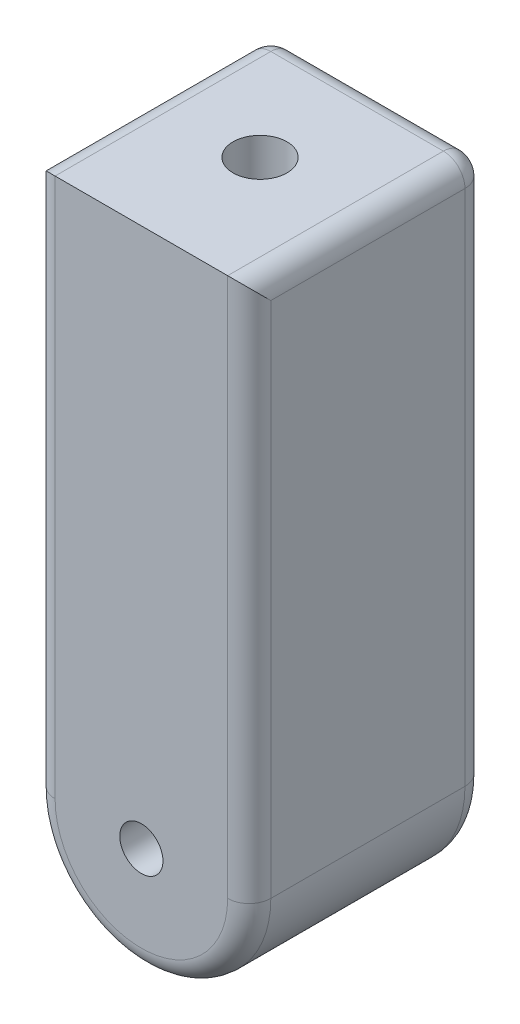
ISO-10303-21;
HEADER;
FILE_DESCRIPTION(('STEP AP214'),'2;1');
FILE_NAME('part.step','',(''),(''),'','','');
FILE_SCHEMA(('AUTOMOTIVE_DESIGN { 1 0 10303 214 1 1 1 1 }'));
ENDSEC;
DATA;
#1=APPLICATION_CONTEXT('core data for automotive mechanical design processes');
#2=APPLICATION_PROTOCOL_DEFINITION('international standard','automotive_design',2000,#1);
#3=PRODUCT_CONTEXT('',#1,'mechanical');
#4=PRODUCT('Part','Part','',(#3));
#5=PRODUCT_RELATED_PRODUCT_CATEGORY('part','',(#4));
#6=PRODUCT_DEFINITION_FORMATION('','',#4);
#7=PRODUCT_DEFINITION_CONTEXT('part definition',#1,'design');
#8=PRODUCT_DEFINITION('design','',#6,#7);
#9=PRODUCT_DEFINITION_SHAPE('','',#8);
#10=(LENGTH_UNIT() NAMED_UNIT(*) SI_UNIT(.MILLI.,.METRE.));
#11=(NAMED_UNIT(*) PLANE_ANGLE_UNIT() SI_UNIT($,.RADIAN.));
#12=(NAMED_UNIT(*) SI_UNIT($,.STERADIAN.) SOLID_ANGLE_UNIT());
#13=UNCERTAINTY_MEASURE_WITH_UNIT(LENGTH_MEASURE(1.E-05),#10,'distance_accuracy_value','');
#14=(GEOMETRIC_REPRESENTATION_CONTEXT(3) GLOBAL_UNCERTAINTY_ASSIGNED_CONTEXT((#13)) GLOBAL_UNIT_ASSIGNED_CONTEXT((#10,
#11,#12)) REPRESENTATION_CONTEXT('',''));
#15=CARTESIAN_POINT('',(0.,0.,0.));
#16=DIRECTION('',(0.,0.,1.));
#17=DIRECTION('',(1.,0.,0.));
#18=AXIS2_PLACEMENT_3D('',#15,#16,#17);
#19=CARTESIAN_POINT('',(50.,0.,55.));
#20=DIRECTION('',(1.,0.,0.));
#21=DIRECTION('',(0.,1.,0.));
#22=AXIS2_PLACEMENT_3D('',#19,#20,#21);
#23=PLANE('',#22);
#24=DIRECTION('',(0.,0.,-1.));
#25=VECTOR('',#24,1.);
#26=CARTESIAN_POINT('',(50.,-150.,55.));
#27=LINE('',#26,#25);
#28=CARTESIAN_POINT('',(50.,-150.,45.));
#29=VERTEX_POINT('',#28);
#30=CARTESIAN_POINT('',(50.,-150.,-45.));
#31=VERTEX_POINT('',#30);
#32=EDGE_CURVE('E136',#29,#31,#27,.T.);
#33=ORIENTED_EDGE('',*,*,#32,.T.);
#34=DIRECTION('',(0.,-1.,0.));
#35=VECTOR('',#34,1.);
#36=CARTESIAN_POINT('',(50.,100.,-45.));
#37=LINE('',#36,#35);
#38=CARTESIAN_POINT('',(50.,90.,-45.));
#39=VERTEX_POINT('',#38);
#40=EDGE_CURVE('E51',#31,#39,#37,.F.);
#41=ORIENTED_EDGE('',*,*,#40,.T.);
#42=DIRECTION('',(0.,0.,-1.));
#43=VECTOR('',#42,1.);
#44=CARTESIAN_POINT('',(50.,90.,55.));
#45=LINE('',#44,#43);
#46=CARTESIAN_POINT('',(50.,90.,45.));
#47=VERTEX_POINT('',#46);
#48=EDGE_CURVE('E63',#39,#47,#45,.F.);
#49=ORIENTED_EDGE('',*,*,#48,.T.);
#50=DIRECTION('',(0.,-1.,0.));
#51=VECTOR('',#50,1.);
#52=CARTESIAN_POINT('',(50.,0.,45.));
#53=LINE('',#52,#51);
#54=EDGE_CURVE('E126',#47,#29,#53,.T.);
#55=ORIENTED_EDGE('',*,*,#54,.T.);
#56=EDGE_LOOP('',(#33,#41,#49,#55));
#57=FACE_BOUND('',#56,.T.);
#58=ADVANCED_FACE('F41',(#57),#23,.T.);
#59=CARTESIAN_POINT('',(0.,100.,55.));
#60=DIRECTION('',(0.,1.,0.));
#61=DIRECTION('',(0.,0.,1.));
#62=AXIS2_PLACEMENT_3D('',#59,#60,#61);
#63=PLANE('',#62);
#64=CARTESIAN_POINT('',(0.,100.,0.));
#65=DIRECTION('',(0.,1.,0.));
#66=DIRECTION('',(0.,0.,1.));
#67=AXIS2_PLACEMENT_3D('',#64,#65,#66);
#68=CIRCLE('',#67,12.5);
#69=CARTESIAN_POINT('',(0.,100.,12.5));
#70=VERTEX_POINT('',#69);
#71=EDGE_CURVE('E241',#70,#70,#68,.T.);
#72=ORIENTED_EDGE('',*,*,#71,.F.);
#73=EDGE_LOOP('',(#72));
#74=FACE_BOUND('',#73,.T.);
#75=DIRECTION('',(1.,0.,0.));
#76=VECTOR('',#75,1.);
#77=CARTESIAN_POINT('',(-50.,100.,-45.));
#78=LINE('',#77,#76);
#79=CARTESIAN_POINT('',(40.,100.,-45.));
#80=VERTEX_POINT('',#79);
#81=CARTESIAN_POINT('',(-40.,100.,-45.));
#82=VERTEX_POINT('',#81);
#83=EDGE_CURVE('E120',#80,#82,#78,.F.);
#84=ORIENTED_EDGE('',*,*,#83,.T.);
#85=DIRECTION('',(0.,0.,-1.));
#86=VECTOR('',#85,1.);
#87=CARTESIAN_POINT('',(-40.,100.,55.));
#88=LINE('',#87,#86);
#89=CARTESIAN_POINT('',(-40.,100.,55.));
#90=VERTEX_POINT('',#89);
#91=EDGE_CURVE('E114',#82,#90,#88,.F.);
#92=ORIENTED_EDGE('',*,*,#91,.T.);
#93=DIRECTION('',(1.,0.,0.));
#94=VECTOR('',#93,1.);
#95=CARTESIAN_POINT('',(0.,100.,55.));
#96=LINE('',#95,#94);
#97=CARTESIAN_POINT('',(40.,100.,55.));
#98=VERTEX_POINT('',#97);
#99=EDGE_CURVE('E117',#90,#98,#96,.T.);
#100=ORIENTED_EDGE('',*,*,#99,.T.);
#101=DIRECTION('',(0.,0.,-1.));
#102=VECTOR('',#101,1.);
#103=CARTESIAN_POINT('',(40.,100.,55.));
#104=LINE('',#103,#102);
#105=EDGE_CURVE('E191',#98,#80,#104,.T.);
#106=ORIENTED_EDGE('',*,*,#105,.T.);
#107=EDGE_LOOP('',(#84,#92,#100,#106));
#108=FACE_BOUND('',#107,.T.);
#109=ADVANCED_FACE('F116',(#74,#108),#63,.T.);
#110=CARTESIAN_POINT('',(-50.,0.,55.));
#111=DIRECTION('',(1.,0.,0.));
#112=DIRECTION('',(0.,1.,0.));
#113=AXIS2_PLACEMENT_3D('',#110,#111,#112);
#114=PLANE('',#113);
#115=DIRECTION('',(0.,0.,-1.));
#116=VECTOR('',#115,1.);
#117=CARTESIAN_POINT('',(-50.,-150.,55.));
#118=LINE('',#117,#116);
#119=CARTESIAN_POINT('',(-50.,-150.,45.));
#120=VERTEX_POINT('',#119);
#121=CARTESIAN_POINT('',(-50.,-150.,-45.));
#122=VERTEX_POINT('',#121);
#123=EDGE_CURVE('E261',#120,#122,#118,.T.);
#124=ORIENTED_EDGE('',*,*,#123,.F.);
#125=DIRECTION('',(0.,-1.,0.));
#126=VECTOR('',#125,1.);
#127=CARTESIAN_POINT('',(-50.,100.,45.));
#128=LINE('',#127,#126);
#129=CARTESIAN_POINT('',(-50.,90.,45.));
#130=VERTEX_POINT('',#129);
#131=EDGE_CURVE('E165',#120,#130,#128,.F.);
#132=ORIENTED_EDGE('',*,*,#131,.T.);
#133=DIRECTION('',(0.,0.,-1.));
#134=VECTOR('',#133,1.);
#135=CARTESIAN_POINT('',(-50.,90.,-55.));
#136=LINE('',#135,#134);
#137=CARTESIAN_POINT('',(-50.,90.,-45.));
#138=VERTEX_POINT('',#137);
#139=EDGE_CURVE('E142',#130,#138,#136,.T.);
#140=ORIENTED_EDGE('',*,*,#139,.T.);
#141=DIRECTION('',(0.,-1.,0.));
#142=VECTOR('',#141,1.);
#143=CARTESIAN_POINT('',(-50.,0.,-45.));
#144=LINE('',#143,#142);
#145=EDGE_CURVE('E158',#138,#122,#144,.T.);
#146=ORIENTED_EDGE('',*,*,#145,.T.);
#147=EDGE_LOOP('',(#124,#132,#140,#146));
#148=FACE_BOUND('',#147,.T.);
#149=ADVANCED_FACE('F309',(#148),#114,.F.);
#150=CARTESIAN_POINT('',(0.,-150.,55.));
#151=DIRECTION('',(0.,0.,-1.));
#152=DIRECTION('',(-1.,0.,0.));
#153=AXIS2_PLACEMENT_3D('',#150,#151,#152);
#154=CYLINDRICAL_SURFACE('',#153,50.);
#155=ORIENTED_EDGE('',*,*,#32,.F.);
#156=CARTESIAN_POINT('',(0.,-150.,45.));
#157=DIRECTION('',(0.,0.,1.));
#158=DIRECTION('',(1.,0.,0.));
#159=AXIS2_PLACEMENT_3D('',#156,#157,#158);
#160=CIRCLE('',#159,50.);
#161=EDGE_CURVE('E171',#29,#120,#160,.F.);
#162=ORIENTED_EDGE('',*,*,#161,.T.);
#163=ORIENTED_EDGE('',*,*,#123,.T.);
#164=CARTESIAN_POINT('',(0.,-150.,-45.));
#165=DIRECTION('',(0.,0.,1.));
#166=DIRECTION('',(1.,0.,0.));
#167=AXIS2_PLACEMENT_3D('',#164,#165,#166);
#168=CIRCLE('',#167,50.);
#169=EDGE_CURVE('E168',#122,#31,#168,.T.);
#170=ORIENTED_EDGE('',*,*,#169,.T.);
#171=EDGE_LOOP('',(#155,#162,#163,#170));
#172=FACE_BOUND('',#171,.T.);
#173=ADVANCED_FACE('F268',(#172),#154,.T.);
#174=CARTESIAN_POINT('',(0.,0.,55.));
#175=DIRECTION('',(0.,0.,1.));
#176=DIRECTION('',(1.,0.,0.));
#177=AXIS2_PLACEMENT_3D('',#174,#175,#176);
#178=PLANE('',#177);
#179=CARTESIAN_POINT('',(0.,-150.,55.));
#180=DIRECTION('',(0.,0.,1.));
#181=DIRECTION('',(1.,0.,0.));
#182=AXIS2_PLACEMENT_3D('',#179,#180,#181);
#183=CIRCLE('',#182,10.);
#184=CARTESIAN_POINT('',(10.,-150.,55.));
#185=VERTEX_POINT('',#184);
#186=EDGE_CURVE('E137',#185,#185,#183,.T.);
#187=ORIENTED_EDGE('',*,*,#186,.F.);
#188=EDGE_LOOP('',(#187));
#189=FACE_BOUND('',#188,.T.);
#190=ORIENTED_EDGE('',*,*,#99,.F.);
#191=DIRECTION('',(0.,-1.,0.));
#192=VECTOR('',#191,1.);
#193=CARTESIAN_POINT('',(-40.,-150.,55.));
#194=LINE('',#193,#192);
#195=CARTESIAN_POINT('',(-40.,-150.,55.));
#196=VERTEX_POINT('',#195);
#197=EDGE_CURVE('E132',#90,#196,#194,.T.);
#198=ORIENTED_EDGE('',*,*,#197,.T.);
#199=CARTESIAN_POINT('',(0.,-150.,55.));
#200=DIRECTION('',(0.,0.,1.));
#201=DIRECTION('',(1.,0.,0.));
#202=AXIS2_PLACEMENT_3D('',#199,#200,#201);
#203=CIRCLE('',#202,40.);
#204=CARTESIAN_POINT('',(40.,-150.,55.));
#205=VERTEX_POINT('',#204);
#206=EDGE_CURVE('E154',#196,#205,#203,.T.);
#207=ORIENTED_EDGE('',*,*,#206,.T.);
#208=DIRECTION('',(0.,-1.,0.));
#209=VECTOR('',#208,1.);
#210=CARTESIAN_POINT('',(40.,0.,55.));
#211=LINE('',#210,#209);
#212=EDGE_CURVE('E134',#205,#98,#211,.F.);
#213=ORIENTED_EDGE('',*,*,#212,.T.);
#214=EDGE_LOOP('',(#190,#198,#207,#213));
#215=FACE_BOUND('',#214,.T.);
#216=ADVANCED_FACE('F130',(#189,#215),#178,.T.);
#217=CARTESIAN_POINT('',(0.,0.,-55.));
#218=DIRECTION('',(0.,0.,1.));
#219=DIRECTION('',(1.,0.,0.));
#220=AXIS2_PLACEMENT_3D('',#217,#218,#219);
#221=PLANE('',#220);
#222=DIRECTION('',(0.,-1.,0.));
#223=VECTOR('',#222,1.);
#224=CARTESIAN_POINT('',(-40.,0.,-55.));
#225=LINE('',#224,#223);
#226=CARTESIAN_POINT('',(-40.,-150.,-55.));
#227=VERTEX_POINT('',#226);
#228=CARTESIAN_POINT('',(-40.,90.,-55.));
#229=VERTEX_POINT('',#228);
#230=EDGE_CURVE('E184',#227,#229,#225,.F.);
#231=ORIENTED_EDGE('',*,*,#230,.T.);
#232=DIRECTION('',(1.,0.,0.));
#233=VECTOR('',#232,1.);
#234=CARTESIAN_POINT('',(50.,90.,-55.));
#235=LINE('',#234,#233);
#236=CARTESIAN_POINT('',(40.,90.,-55.));
#237=VERTEX_POINT('',#236);
#238=EDGE_CURVE('E187',#229,#237,#235,.T.);
#239=ORIENTED_EDGE('',*,*,#238,.T.);
#240=DIRECTION('',(0.,-1.,0.));
#241=VECTOR('',#240,1.);
#242=CARTESIAN_POINT('',(40.,-150.,-55.));
#243=LINE('',#242,#241);
#244=CARTESIAN_POINT('',(40.,-150.,-55.));
#245=VERTEX_POINT('',#244);
#246=EDGE_CURVE('E178',#237,#245,#243,.T.);
#247=ORIENTED_EDGE('',*,*,#246,.T.);
#248=CARTESIAN_POINT('',(0.,-150.,-55.));
#249=DIRECTION('',(0.,0.,1.));
#250=DIRECTION('',(1.,0.,0.));
#251=AXIS2_PLACEMENT_3D('',#248,#249,#250);
#252=CIRCLE('',#251,40.);
#253=EDGE_CURVE('E181',#245,#227,#252,.F.);
#254=ORIENTED_EDGE('',*,*,#253,.T.);
#255=EDGE_LOOP('',(#231,#239,#247,#254));
#256=FACE_BOUND('',#255,.T.);
#257=CARTESIAN_POINT('',(0.,-150.,-55.));
#258=DIRECTION('',(0.,0.,1.));
#259=DIRECTION('',(1.,0.,0.));
#260=AXIS2_PLACEMENT_3D('',#257,#258,#259);
#261=CIRCLE('',#260,20.);
#262=CARTESIAN_POINT('',(20.,-150.,-55.));
#263=VERTEX_POINT('',#262);
#264=EDGE_CURVE('E174',#263,#263,#261,.T.);
#265=ORIENTED_EDGE('',*,*,#264,.T.);
#266=EDGE_LOOP('',(#265));
#267=FACE_BOUND('',#266,.T.);
#268=ADVANCED_FACE('F280',(#256,#267),#221,.F.);
#269=CARTESIAN_POINT('',(0.,-150.,-83.2842712474619));
#270=DIRECTION('',(0.,0.,1.));
#271=DIRECTION('',(1.,0.,0.));
#272=AXIS2_PLACEMENT_3D('',#269,#270,#271);
#273=CYLINDRICAL_SURFACE('',#272,10.);
#274=CARTESIAN_POINT('',(0.,-150.,-45.));
#275=DIRECTION('',(0.,0.,1.));
#276=DIRECTION('',(1.,0.,0.));
#277=AXIS2_PLACEMENT_3D('',#274,#275,#276);
#278=CIRCLE('',#277,10.);
#279=CARTESIAN_POINT('',(10.,-150.,-45.));
#280=VERTEX_POINT('',#279);
#281=EDGE_CURVE('E11',#280,#280,#278,.F.);
#282=ORIENTED_EDGE('',*,*,#281,.T.);
#283=EDGE_LOOP('',(#282));
#284=FACE_BOUND('',#283,.T.);
#285=ORIENTED_EDGE('',*,*,#186,.T.);
#286=EDGE_LOOP('',(#285));
#287=FACE_BOUND('',#286,.T.);
#288=ADVANCED_FACE('F419',(#284,#287),#273,.F.);
#289=CARTESIAN_POINT('',(0.,0.,0.));
#290=DIRECTION('',(0.,1.,0.));
#291=DIRECTION('',(0.,0.,1.));
#292=AXIS2_PLACEMENT_3D('',#289,#290,#291);
#293=CYLINDRICAL_SURFACE('',#292,12.5);
#294=CARTESIAN_POINT('',(0.,0.,0.));
#295=DIRECTION('',(0.,1.,0.));
#296=DIRECTION('',(0.,0.,1.));
#297=AXIS2_PLACEMENT_3D('',#294,#295,#296);
#298=CIRCLE('',#297,12.5);
#299=CARTESIAN_POINT('',(0.,0.,12.5));
#300=VERTEX_POINT('',#299);
#301=EDGE_CURVE('E248',#300,#300,#298,.T.);
#302=ORIENTED_EDGE('',*,*,#301,.F.);
#303=EDGE_LOOP('',(#302));
#304=FACE_BOUND('',#303,.T.);
#305=ORIENTED_EDGE('',*,*,#71,.T.);
#306=EDGE_LOOP('',(#305));
#307=FACE_BOUND('',#306,.T.);
#308=ADVANCED_FACE('F301',(#304,#307),#293,.F.);
#309=CARTESIAN_POINT('',(0.,0.,0.));
#310=DIRECTION('',(0.,1.,0.));
#311=DIRECTION('',(0.,0.,1.));
#312=AXIS2_PLACEMENT_3D('',#309,#310,#311);
#313=PLANE('',#312);
#314=ORIENTED_EDGE('',*,*,#301,.T.);
#315=EDGE_LOOP('',(#314));
#316=FACE_BOUND('',#315,.T.);
#317=ADVANCED_FACE('F295',(#316),#313,.T.);
#318=CARTESIAN_POINT('',(40.,0.,-45.));
#319=DIRECTION('',(0.,1.,0.));
#320=DIRECTION('',(-1.,0.,0.));
#321=AXIS2_PLACEMENT_3D('',#318,#319,#320);
#322=CYLINDRICAL_SURFACE('',#321,10.);
#323=CARTESIAN_POINT('',(40.,90.,-45.));
#324=DIRECTION('',(0.,1.,0.));
#325=DIRECTION('',(0.,0.,1.));
#326=AXIS2_PLACEMENT_3D('',#323,#324,#325);
#327=CIRCLE('',#326,10.);
#328=EDGE_CURVE('E232',#39,#237,#327,.T.);
#329=ORIENTED_EDGE('',*,*,#328,.F.);
#330=ORIENTED_EDGE('',*,*,#40,.F.);
#331=CARTESIAN_POINT('',(40.,-150.,-45.));
#332=DIRECTION('',(0.,-1.,0.));
#333=DIRECTION('',(0.,0.,-1.));
#334=AXIS2_PLACEMENT_3D('',#331,#332,#333);
#335=CIRCLE('',#334,10.);
#336=EDGE_CURVE('E45',#245,#31,#335,.T.);
#337=ORIENTED_EDGE('',*,*,#336,.F.);
#338=ORIENTED_EDGE('',*,*,#246,.F.);
#339=EDGE_LOOP('',(#329,#330,#337,#338));
#340=FACE_BOUND('',#339,.T.);
#341=ADVANCED_FACE('F293',(#340),#322,.T.);
#342=CARTESIAN_POINT('',(0.,-150.,-45.));
#343=DIRECTION('',(0.,0.,1.));
#344=DIRECTION('',(1.,0.,0.));
#345=AXIS2_PLACEMENT_3D('',#342,#343,#344);
#346=TOROIDAL_SURFACE('',#345,40.,10.);
#347=ORIENTED_EDGE('',*,*,#336,.T.);
#348=ORIENTED_EDGE('',*,*,#169,.F.);
#349=CARTESIAN_POINT('',(-40.,-150.,-45.));
#350=DIRECTION('',(0.,1.,0.));
#351=DIRECTION('',(0.,0.,1.));
#352=AXIS2_PLACEMENT_3D('',#349,#350,#351);
#353=CIRCLE('',#352,10.);
#354=EDGE_CURVE('E229',#227,#122,#353,.T.);
#355=ORIENTED_EDGE('',*,*,#354,.F.);
#356=ORIENTED_EDGE('',*,*,#253,.F.);
#357=EDGE_LOOP('',(#347,#348,#355,#356));
#358=FACE_BOUND('',#357,.T.);
#359=ADVANCED_FACE('F272',(#358),#346,.T.);
#360=CARTESIAN_POINT('',(40.,90.,-45.));
#361=DIRECTION('',(0.,0.,-1.));
#362=DIRECTION('',(-1.,0.,0.));
#363=AXIS2_PLACEMENT_3D('',#360,#361,#362);
#364=SPHERICAL_SURFACE('',#363,10.);
#365=CARTESIAN_POINT('',(40.,90.,-45.));
#366=DIRECTION('',(0.,0.,-1.));
#367=DIRECTION('',(-1.,0.,0.));
#368=AXIS2_PLACEMENT_3D('',#365,#366,#367);
#369=CIRCLE('',#368,10.);
#370=EDGE_CURVE('E222',#39,#80,#369,.F.);
#371=ORIENTED_EDGE('',*,*,#370,.F.);
#372=ORIENTED_EDGE('',*,*,#328,.T.);
#373=CARTESIAN_POINT('',(40.,90.,-45.));
#374=DIRECTION('',(1.,0.,0.));
#375=DIRECTION('',(0.,1.,0.));
#376=AXIS2_PLACEMENT_3D('',#373,#374,#375);
#377=CIRCLE('',#376,10.);
#378=EDGE_CURVE('E226',#80,#237,#377,.F.);
#379=ORIENTED_EDGE('',*,*,#378,.F.);
#380=EDGE_LOOP('',(#371,#372,#379));
#381=FACE_BOUND('',#380,.T.);
#382=ADVANCED_FACE('F285',(#381),#364,.T.);
#383=CARTESIAN_POINT('',(-40.,0.,-45.));
#384=DIRECTION('',(0.,-1.,0.));
#385=DIRECTION('',(1.,0.,0.));
#386=AXIS2_PLACEMENT_3D('',#383,#384,#385);
#387=CYLINDRICAL_SURFACE('',#386,10.);
#388=ORIENTED_EDGE('',*,*,#354,.T.);
#389=ORIENTED_EDGE('',*,*,#145,.F.);
#390=CARTESIAN_POINT('',(-40.,90.,-45.));
#391=DIRECTION('',(0.,1.,0.));
#392=DIRECTION('',(0.,0.,1.));
#393=AXIS2_PLACEMENT_3D('',#390,#391,#392);
#394=CIRCLE('',#393,10.);
#395=EDGE_CURVE('E218',#229,#138,#394,.T.);
#396=ORIENTED_EDGE('',*,*,#395,.F.);
#397=ORIENTED_EDGE('',*,*,#230,.F.);
#398=EDGE_LOOP('',(#388,#389,#396,#397));
#399=FACE_BOUND('',#398,.T.);
#400=ADVANCED_FACE('F276',(#399),#387,.T.);
#401=CARTESIAN_POINT('',(0.,90.,-45.));
#402=DIRECTION('',(-1.,0.,0.));
#403=DIRECTION('',(0.,0.,1.));
#404=AXIS2_PLACEMENT_3D('',#401,#402,#403);
#405=CYLINDRICAL_SURFACE('',#404,10.);
#406=ORIENTED_EDGE('',*,*,#378,.T.);
#407=ORIENTED_EDGE('',*,*,#238,.F.);
#408=CARTESIAN_POINT('',(-40.,90.,-45.));
#409=DIRECTION('',(-1.,0.,0.));
#410=DIRECTION('',(0.,0.,1.));
#411=AXIS2_PLACEMENT_3D('',#408,#409,#410);
#412=CIRCLE('',#411,10.);
#413=EDGE_CURVE('E214',#82,#229,#412,.T.);
#414=ORIENTED_EDGE('',*,*,#413,.F.);
#415=ORIENTED_EDGE('',*,*,#83,.F.);
#416=EDGE_LOOP('',(#406,#407,#414,#415));
#417=FACE_BOUND('',#416,.T.);
#418=ADVANCED_FACE('F283',(#417),#405,.T.);
#419=CARTESIAN_POINT('',(40.,90.,55.));
#420=DIRECTION('',(0.,0.,-1.));
#421=DIRECTION('',(-1.,0.,0.));
#422=AXIS2_PLACEMENT_3D('',#419,#420,#421);
#423=CYLINDRICAL_SURFACE('',#422,10.);
#424=ORIENTED_EDGE('',*,*,#370,.T.);
#425=ORIENTED_EDGE('',*,*,#105,.F.);
#426=CARTESIAN_POINT('',(40.,90.,45.));
#427=DIRECTION('',(0.,-0.707106781186547,0.707106781186547));
#428=DIRECTION('',(0.,-0.707106781186547,-0.707106781186547));
#429=AXIS2_PLACEMENT_3D('',#426,#427,#428);
#430=ELLIPSE('',#429,14.1421356237309,10.);
#431=EDGE_CURVE('E210',#47,#98,#430,.T.);
#432=ORIENTED_EDGE('',*,*,#431,.F.);
#433=ORIENTED_EDGE('',*,*,#48,.F.);
#434=EDGE_LOOP('',(#424,#425,#432,#433));
#435=FACE_BOUND('',#434,.T.);
#436=ADVANCED_FACE('F287',(#435),#423,.T.);
#437=CARTESIAN_POINT('',(-40.,90.,-45.));
#438=DIRECTION('',(0.,0.,-1.));
#439=DIRECTION('',(-1.,0.,0.));
#440=AXIS2_PLACEMENT_3D('',#437,#438,#439);
#441=SPHERICAL_SURFACE('',#440,10.);
#442=ORIENTED_EDGE('',*,*,#413,.T.);
#443=ORIENTED_EDGE('',*,*,#395,.T.);
#444=CARTESIAN_POINT('',(-40.,90.,-45.));
#445=DIRECTION('',(0.,0.,-1.));
#446=DIRECTION('',(0.,1.,0.));
#447=AXIS2_PLACEMENT_3D('',#444,#445,#446);
#448=CIRCLE('',#447,10.);
#449=EDGE_CURVE('E207',#82,#138,#448,.F.);
#450=ORIENTED_EDGE('',*,*,#449,.F.);
#451=EDGE_LOOP('',(#442,#443,#450));
#452=FACE_BOUND('',#451,.T.);
#453=ADVANCED_FACE('F324',(#452),#441,.T.);
#454=CARTESIAN_POINT('',(40.,0.,45.));
#455=DIRECTION('',(0.,-1.,0.));
#456=DIRECTION('',(1.,0.,0.));
#457=AXIS2_PLACEMENT_3D('',#454,#455,#456);
#458=CYLINDRICAL_SURFACE('',#457,10.);
#459=ORIENTED_EDGE('',*,*,#431,.T.);
#460=ORIENTED_EDGE('',*,*,#212,.F.);
#461=CARTESIAN_POINT('',(40.,-150.,45.));
#462=DIRECTION('',(0.,-1.,0.));
#463=DIRECTION('',(0.,0.,-1.));
#464=AXIS2_PLACEMENT_3D('',#461,#462,#463);
#465=CIRCLE('',#464,10.);
#466=EDGE_CURVE('E147',#29,#205,#465,.T.);
#467=ORIENTED_EDGE('',*,*,#466,.F.);
#468=ORIENTED_EDGE('',*,*,#54,.F.);
#469=EDGE_LOOP('',(#459,#460,#467,#468));
#470=FACE_BOUND('',#469,.T.);
#471=ADVANCED_FACE('F291',(#470),#458,.T.);
#472=CARTESIAN_POINT('',(-40.,90.,55.));
#473=DIRECTION('',(0.,0.,1.));
#474=DIRECTION('',(1.,0.,0.));
#475=AXIS2_PLACEMENT_3D('',#472,#473,#474);
#476=CYLINDRICAL_SURFACE('',#475,10.);
#477=ORIENTED_EDGE('',*,*,#449,.T.);
#478=ORIENTED_EDGE('',*,*,#139,.F.);
#479=CARTESIAN_POINT('',(-40.,90.,45.));
#480=DIRECTION('',(0.,-0.707106781186547,0.707106781186547));
#481=DIRECTION('',(0.,0.707106781186547,0.707106781186547));
#482=AXIS2_PLACEMENT_3D('',#479,#480,#481);
#483=ELLIPSE('',#482,14.1421356237309,10.);
#484=EDGE_CURVE('E140',#90,#130,#483,.T.);
#485=ORIENTED_EDGE('',*,*,#484,.F.);
#486=ORIENTED_EDGE('',*,*,#91,.F.);
#487=EDGE_LOOP('',(#477,#478,#485,#486));
#488=FACE_BOUND('',#487,.T.);
#489=ADVANCED_FACE('F141',(#488),#476,.T.);
#490=CARTESIAN_POINT('',(0.,-150.,45.));
#491=DIRECTION('',(0.,0.,1.));
#492=DIRECTION('',(1.,0.,0.));
#493=AXIS2_PLACEMENT_3D('',#490,#491,#492);
#494=TOROIDAL_SURFACE('',#493,40.,10.);
#495=ORIENTED_EDGE('',*,*,#466,.T.);
#496=ORIENTED_EDGE('',*,*,#206,.F.);
#497=CARTESIAN_POINT('',(-40.,-150.,45.));
#498=DIRECTION('',(0.,1.,0.));
#499=DIRECTION('',(0.,0.,1.));
#500=AXIS2_PLACEMENT_3D('',#497,#498,#499);
#501=CIRCLE('',#500,10.);
#502=EDGE_CURVE('E148',#120,#196,#501,.T.);
#503=ORIENTED_EDGE('',*,*,#502,.F.);
#504=ORIENTED_EDGE('',*,*,#161,.F.);
#505=EDGE_LOOP('',(#495,#496,#503,#504));
#506=FACE_BOUND('',#505,.T.);
#507=ADVANCED_FACE('F316',(#506),#494,.T.);
#508=CARTESIAN_POINT('',(-40.,0.,45.));
#509=DIRECTION('',(0.,1.,0.));
#510=DIRECTION('',(-1.,0.,0.));
#511=AXIS2_PLACEMENT_3D('',#508,#509,#510);
#512=CYLINDRICAL_SURFACE('',#511,10.);
#513=ORIENTED_EDGE('',*,*,#484,.T.);
#514=ORIENTED_EDGE('',*,*,#131,.F.);
#515=ORIENTED_EDGE('',*,*,#502,.T.);
#516=ORIENTED_EDGE('',*,*,#197,.F.);
#517=EDGE_LOOP('',(#513,#514,#515,#516));
#518=FACE_BOUND('',#517,.T.);
#519=ADVANCED_FACE('F150',(#518),#512,.T.);
#520=CARTESIAN_POINT('',(0.,-150.,-45.));
#521=DIRECTION('',(0.,0.,1.));
#522=DIRECTION('',(1.,0.,0.));
#523=AXIS2_PLACEMENT_3D('',#520,#521,#522);
#524=TOROIDAL_SURFACE('',#523,20.,10.);
#525=ORIENTED_EDGE('',*,*,#264,.F.);
#526=EDGE_LOOP('',(#525));
#527=FACE_BOUND('',#526,.T.);
#528=ORIENTED_EDGE('',*,*,#281,.F.);
#529=EDGE_LOOP('',(#528));
#530=FACE_BOUND('',#529,.T.);
#531=ADVANCED_FACE('F43',(#527,#530),#524,.T.);
#532=CLOSED_SHELL('',(#58,#109,#149,#173,#216,#268,#288,#308,#317,#341,#359,#382,#400,#418,#436,
#453,#471,#489,#507,#519,#531));
#533=MANIFOLD_SOLID_BREP('B2',#532);
#534=ADVANCED_BREP_SHAPE_REPRESENTATION('',(#18,#533),#14);
#535=SHAPE_DEFINITION_REPRESENTATION(#9,#534);
ENDSEC;
END-ISO-10303-21;
